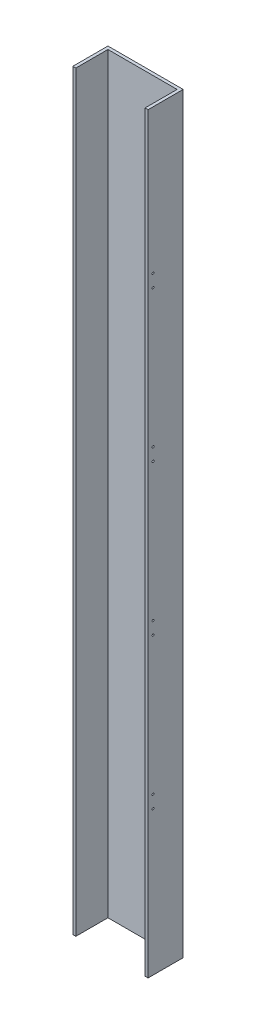
ISO-10303-21;
HEADER;
FILE_DESCRIPTION(('STEP AP214'),'2;1');
FILE_NAME('part.step','',(''),(''),'','','');
FILE_SCHEMA(('AUTOMOTIVE_DESIGN { 1 0 10303 214 1 1 1 1 }'));
ENDSEC;
DATA;
#1=APPLICATION_CONTEXT('core data for automotive mechanical design processes');
#2=APPLICATION_PROTOCOL_DEFINITION('international standard','automotive_design',2000,#1);
#3=PRODUCT_CONTEXT('',#1,'mechanical');
#4=PRODUCT('Part','Part','',(#3));
#5=PRODUCT_RELATED_PRODUCT_CATEGORY('part','',(#4));
#6=PRODUCT_DEFINITION_FORMATION('','',#4);
#7=PRODUCT_DEFINITION_CONTEXT('part definition',#1,'design');
#8=PRODUCT_DEFINITION('design','',#6,#7);
#9=PRODUCT_DEFINITION_SHAPE('','',#8);
#10=(LENGTH_UNIT() NAMED_UNIT(*) SI_UNIT(.MILLI.,.METRE.));
#11=(NAMED_UNIT(*) PLANE_ANGLE_UNIT() SI_UNIT($,.RADIAN.));
#12=(NAMED_UNIT(*) SI_UNIT($,.STERADIAN.) SOLID_ANGLE_UNIT());
#13=UNCERTAINTY_MEASURE_WITH_UNIT(LENGTH_MEASURE(1.E-05),#10,'distance_accuracy_value','');
#14=(GEOMETRIC_REPRESENTATION_CONTEXT(3) GLOBAL_UNCERTAINTY_ASSIGNED_CONTEXT((#13)) GLOBAL_UNIT_ASSIGNED_CONTEXT((#10,
#11,#12)) REPRESENTATION_CONTEXT('',''));
#15=CARTESIAN_POINT('',(0.,0.,0.));
#16=DIRECTION('',(0.,0.,1.));
#17=DIRECTION('',(1.,0.,0.));
#18=AXIS2_PLACEMENT_3D('',#15,#16,#17);
#19=CARTESIAN_POINT('',(75.,1500.,-35.));
#20=DIRECTION('',(0.,0.,1.));
#21=DIRECTION('',(1.,0.,0.));
#22=AXIS2_PLACEMENT_3D('',#19,#20,#21);
#23=PLANE('',#22);
#24=CARTESIAN_POINT('',(26.7499999999954,75.0000000000002,-35.));
#25=DIRECTION('',(0.,0.,-1.));
#26=DIRECTION('',(-1.,0.,0.));
#27=AXIS2_PLACEMENT_3D('',#24,#25,#26);
#28=CIRCLE('',#27,2.5);
#29=CARTESIAN_POINT('',(24.2499999999954,75.0000000000002,-35.));
#30=VERTEX_POINT('',#29);
#31=EDGE_CURVE('E342',#30,#30,#28,.T.);
#32=ORIENTED_EDGE('',*,*,#31,.F.);
#33=EDGE_LOOP('',(#32));
#34=FACE_BOUND('',#33,.T.);
#35=CARTESIAN_POINT('',(26.7499999999959,225.,-35.));
#36=DIRECTION('',(0.,0.,-1.));
#37=DIRECTION('',(-1.,0.,0.));
#38=AXIS2_PLACEMENT_3D('',#35,#36,#37);
#39=CIRCLE('',#38,2.5);
#40=CARTESIAN_POINT('',(24.2499999999959,225.,-35.));
#41=VERTEX_POINT('',#40);
#42=EDGE_CURVE('E334',#41,#41,#39,.T.);
#43=ORIENTED_EDGE('',*,*,#42,.F.);
#44=EDGE_LOOP('',(#43));
#45=FACE_BOUND('',#44,.T.);
#46=CARTESIAN_POINT('',(26.7499999999964,375.,-35.));
#47=DIRECTION('',(0.,0.,-1.));
#48=DIRECTION('',(-1.,0.,0.));
#49=AXIS2_PLACEMENT_3D('',#46,#47,#48);
#50=CIRCLE('',#49,2.5);
#51=CARTESIAN_POINT('',(24.2499999999964,375.,-35.));
#52=VERTEX_POINT('',#51);
#53=EDGE_CURVE('E326',#52,#52,#50,.T.);
#54=ORIENTED_EDGE('',*,*,#53,.F.);
#55=EDGE_LOOP('',(#54));
#56=FACE_BOUND('',#55,.T.);
#57=CARTESIAN_POINT('',(26.7499999999969,525.,-35.));
#58=DIRECTION('',(0.,0.,-1.));
#59=DIRECTION('',(-1.,0.,0.));
#60=AXIS2_PLACEMENT_3D('',#57,#58,#59);
#61=CIRCLE('',#60,2.5);
#62=CARTESIAN_POINT('',(24.2499999999969,525.,-35.));
#63=VERTEX_POINT('',#62);
#64=EDGE_CURVE('E318',#63,#63,#61,.T.);
#65=ORIENTED_EDGE('',*,*,#64,.F.);
#66=EDGE_LOOP('',(#65));
#67=FACE_BOUND('',#66,.T.);
#68=CARTESIAN_POINT('',(26.7499999999974,675.,-35.));
#69=DIRECTION('',(0.,0.,-1.));
#70=DIRECTION('',(-1.,0.,0.));
#71=AXIS2_PLACEMENT_3D('',#68,#69,#70);
#72=CIRCLE('',#71,2.5);
#73=CARTESIAN_POINT('',(24.2499999999974,675.,-35.));
#74=VERTEX_POINT('',#73);
#75=EDGE_CURVE('E310',#74,#74,#72,.T.);
#76=ORIENTED_EDGE('',*,*,#75,.F.);
#77=EDGE_LOOP('',(#76));
#78=FACE_BOUND('',#77,.T.);
#79=CARTESIAN_POINT('',(26.749999999998,825.,-35.));
#80=DIRECTION('',(0.,0.,-1.));
#81=DIRECTION('',(-1.,0.,0.));
#82=AXIS2_PLACEMENT_3D('',#79,#80,#81);
#83=CIRCLE('',#82,2.5);
#84=CARTESIAN_POINT('',(24.249999999998,825.,-35.));
#85=VERTEX_POINT('',#84);
#86=EDGE_CURVE('E302',#85,#85,#83,.T.);
#87=ORIENTED_EDGE('',*,*,#86,.F.);
#88=EDGE_LOOP('',(#87));
#89=FACE_BOUND('',#88,.T.);
#90=CARTESIAN_POINT('',(26.7499999999985,975.,-35.));
#91=DIRECTION('',(0.,0.,-1.));
#92=DIRECTION('',(-1.,0.,0.));
#93=AXIS2_PLACEMENT_3D('',#90,#91,#92);
#94=CIRCLE('',#93,2.5);
#95=CARTESIAN_POINT('',(24.2499999999985,975.,-35.));
#96=VERTEX_POINT('',#95);
#97=EDGE_CURVE('E294',#96,#96,#94,.T.);
#98=ORIENTED_EDGE('',*,*,#97,.F.);
#99=EDGE_LOOP('',(#98));
#100=FACE_BOUND('',#99,.T.);
#101=CARTESIAN_POINT('',(26.749999999999,1125.,-35.));
#102=DIRECTION('',(0.,0.,-1.));
#103=DIRECTION('',(-1.,0.,0.));
#104=AXIS2_PLACEMENT_3D('',#101,#102,#103);
#105=CIRCLE('',#104,2.50000000000011);
#106=CARTESIAN_POINT('',(24.2499999999989,1125.,-35.));
#107=VERTEX_POINT('',#106);
#108=EDGE_CURVE('E286',#107,#107,#105,.T.);
#109=ORIENTED_EDGE('',*,*,#108,.F.);
#110=EDGE_LOOP('',(#109));
#111=FACE_BOUND('',#110,.T.);
#112=CARTESIAN_POINT('',(26.7499999999995,1275.,-35.));
#113=DIRECTION('',(0.,0.,-1.));
#114=DIRECTION('',(-1.,0.,0.));
#115=AXIS2_PLACEMENT_3D('',#112,#113,#114);
#116=CIRCLE('',#115,2.50000000000011);
#117=CARTESIAN_POINT('',(24.2499999999994,1275.,-35.));
#118=VERTEX_POINT('',#117);
#119=EDGE_CURVE('E278',#118,#118,#116,.T.);
#120=ORIENTED_EDGE('',*,*,#119,.F.);
#121=EDGE_LOOP('',(#120));
#122=FACE_BOUND('',#121,.T.);
#123=CARTESIAN_POINT('',(26.75,1425.,-35.));
#124=DIRECTION('',(0.,0.,-1.));
#125=DIRECTION('',(-1.,0.,0.));
#126=AXIS2_PLACEMENT_3D('',#123,#124,#125);
#127=CIRCLE('',#126,2.50000000000012);
#128=CARTESIAN_POINT('',(24.2499999999999,1425.,-35.));
#129=VERTEX_POINT('',#128);
#130=EDGE_CURVE('E270',#129,#129,#127,.T.);
#131=ORIENTED_EDGE('',*,*,#130,.F.);
#132=EDGE_LOOP('',(#131));
#133=FACE_BOUND('',#132,.T.);
#134=DIRECTION('',(-1.,0.,0.));
#135=VECTOR('',#134,1.);
#136=CARTESIAN_POINT('',(75.,0.,-35.));
#137=LINE('',#136,#135);
#138=CARTESIAN_POINT('',(75.,0.,-35.));
#139=VERTEX_POINT('',#138);
#140=CARTESIAN_POINT('',(-75.,0.,-35.));
#141=VERTEX_POINT('',#140);
#142=EDGE_CURVE('E139',#139,#141,#137,.T.);
#143=ORIENTED_EDGE('',*,*,#142,.T.);
#144=DIRECTION('',(0.,-1.,0.));
#145=VECTOR('',#144,1.);
#146=CARTESIAN_POINT('',(-75.,1500.,-35.));
#147=LINE('',#146,#145);
#148=CARTESIAN_POINT('',(-75.,1500.,-35.));
#149=VERTEX_POINT('',#148);
#150=EDGE_CURVE('E11',#149,#141,#147,.T.);
#151=ORIENTED_EDGE('',*,*,#150,.F.);
#152=DIRECTION('',(-1.,0.,0.));
#153=VECTOR('',#152,1.);
#154=CARTESIAN_POINT('',(75.,1500.,-35.));
#155=LINE('',#154,#153);
#156=CARTESIAN_POINT('',(75.,1500.,-35.));
#157=VERTEX_POINT('',#156);
#158=EDGE_CURVE('E162',#157,#149,#155,.T.);
#159=ORIENTED_EDGE('',*,*,#158,.F.);
#160=DIRECTION('',(0.,-1.,0.));
#161=VECTOR('',#160,1.);
#162=CARTESIAN_POINT('',(75.,1500.,-35.));
#163=LINE('',#162,#161);
#164=EDGE_CURVE('E135',#157,#139,#163,.T.);
#165=ORIENTED_EDGE('',*,*,#164,.T.);
#166=EDGE_LOOP('',(#143,#151,#159,#165));
#167=FACE_BOUND('',#166,.T.);
#168=ADVANCED_FACE('F38',(#34,#45,#56,#67,#78,#89,#100,#111,#122,#133,#167),#23,.F.);
#169=CARTESIAN_POINT('',(-75.,1500.,-35.));
#170=DIRECTION('',(1.,0.,0.));
#171=DIRECTION('',(0.,0.,-1.));
#172=AXIS2_PLACEMENT_3D('',#169,#170,#171);
#173=PLANE('',#172);
#174=DIRECTION('',(0.,0.,1.));
#175=VECTOR('',#174,1.);
#176=CARTESIAN_POINT('',(-75.,0.,-35.));
#177=LINE('',#176,#175);
#178=CARTESIAN_POINT('',(-75.,0.,35.));
#179=VERTEX_POINT('',#178);
#180=EDGE_CURVE('E143',#141,#179,#177,.T.);
#181=ORIENTED_EDGE('',*,*,#180,.T.);
#182=DIRECTION('',(0.,-1.,0.));
#183=VECTOR('',#182,1.);
#184=CARTESIAN_POINT('',(-75.,1500.,35.));
#185=LINE('',#184,#183);
#186=CARTESIAN_POINT('',(-75.,1500.,35.));
#187=VERTEX_POINT('',#186);
#188=EDGE_CURVE('E47',#187,#179,#185,.T.);
#189=ORIENTED_EDGE('',*,*,#188,.F.);
#190=DIRECTION('',(0.,0.,1.));
#191=VECTOR('',#190,1.);
#192=CARTESIAN_POINT('',(-75.,1500.,-35.));
#193=LINE('',#192,#191);
#194=EDGE_CURVE('E98',#149,#187,#193,.T.);
#195=ORIENTED_EDGE('',*,*,#194,.F.);
#196=ORIENTED_EDGE('',*,*,#150,.T.);
#197=EDGE_LOOP('',(#181,#189,#195,#196));
#198=FACE_BOUND('',#197,.T.);
#199=ADVANCED_FACE('F361',(#198),#173,.F.);
#200=CARTESIAN_POINT('',(-75.,1500.,35.));
#201=DIRECTION('',(0.,0.,-1.));
#202=DIRECTION('',(-1.,0.,0.));
#203=AXIS2_PLACEMENT_3D('',#200,#201,#202);
#204=PLANE('',#203);
#205=DIRECTION('',(1.,0.,0.));
#206=VECTOR('',#205,1.);
#207=CARTESIAN_POINT('',(-75.,0.,35.));
#208=LINE('',#207,#206);
#209=CARTESIAN_POINT('',(-69.,0.,35.));
#210=VERTEX_POINT('',#209);
#211=EDGE_CURVE('E147',#179,#210,#208,.T.);
#212=ORIENTED_EDGE('',*,*,#211,.T.);
#213=DIRECTION('',(0.,-1.,0.));
#214=VECTOR('',#213,1.);
#215=CARTESIAN_POINT('',(-69.,1500.,35.));
#216=LINE('',#215,#214);
#217=CARTESIAN_POINT('',(-69.,1500.,35.));
#218=VERTEX_POINT('',#217);
#219=EDGE_CURVE('E173',#218,#210,#216,.T.);
#220=ORIENTED_EDGE('',*,*,#219,.F.);
#221=DIRECTION('',(1.,0.,0.));
#222=VECTOR('',#221,1.);
#223=CARTESIAN_POINT('',(-75.,1500.,35.));
#224=LINE('',#223,#222);
#225=EDGE_CURVE('E183',#187,#218,#224,.T.);
#226=ORIENTED_EDGE('',*,*,#225,.F.);
#227=ORIENTED_EDGE('',*,*,#188,.T.);
#228=EDGE_LOOP('',(#212,#220,#226,#227));
#229=FACE_BOUND('',#228,.T.);
#230=ADVANCED_FACE('F181',(#229),#204,.F.);
#231=CARTESIAN_POINT('',(-69.,1500.,35.));
#232=DIRECTION('',(-1.,0.,0.));
#233=DIRECTION('',(0.,0.,1.));
#234=AXIS2_PLACEMENT_3D('',#231,#232,#233);
#235=PLANE('',#234);
#236=DIRECTION('',(0.,0.,-1.));
#237=VECTOR('',#236,1.);
#238=CARTESIAN_POINT('',(-69.,0.,35.));
#239=LINE('',#238,#237);
#240=CARTESIAN_POINT('',(-69.,0.,-29.));
#241=VERTEX_POINT('',#240);
#242=EDGE_CURVE('E150',#210,#241,#239,.T.);
#243=ORIENTED_EDGE('',*,*,#242,.T.);
#244=DIRECTION('',(0.,-1.,0.));
#245=VECTOR('',#244,1.);
#246=CARTESIAN_POINT('',(-69.,1500.,-29.));
#247=LINE('',#246,#245);
#248=CARTESIAN_POINT('',(-69.,1500.,-29.));
#249=VERTEX_POINT('',#248);
#250=EDGE_CURVE('E169',#249,#241,#247,.T.);
#251=ORIENTED_EDGE('',*,*,#250,.F.);
#252=DIRECTION('',(0.,0.,-1.));
#253=VECTOR('',#252,1.);
#254=CARTESIAN_POINT('',(-69.,1500.,35.));
#255=LINE('',#254,#253);
#256=EDGE_CURVE('E196',#218,#249,#255,.T.);
#257=ORIENTED_EDGE('',*,*,#256,.F.);
#258=ORIENTED_EDGE('',*,*,#219,.T.);
#259=EDGE_LOOP('',(#243,#251,#257,#258));
#260=FACE_BOUND('',#259,.T.);
#261=ADVANCED_FACE('F191',(#260),#235,.F.);
#262=CARTESIAN_POINT('',(-69.,1500.,-29.));
#263=DIRECTION('',(0.,0.,-1.));
#264=DIRECTION('',(-1.,0.,0.));
#265=AXIS2_PLACEMENT_3D('',#262,#263,#264);
#266=PLANE('',#265);
#267=CARTESIAN_POINT('',(26.7499999999954,75.0000000000002,-29.));
#268=DIRECTION('',(0.,0.,-1.));
#269=DIRECTION('',(-1.,0.,0.));
#270=AXIS2_PLACEMENT_3D('',#267,#268,#269);
#271=CIRCLE('',#270,2.5);
#272=CARTESIAN_POINT('',(24.2499999999954,75.0000000000002,-29.));
#273=VERTEX_POINT('',#272);
#274=EDGE_CURVE('E266',#273,#273,#271,.T.);
#275=ORIENTED_EDGE('',*,*,#274,.T.);
#276=EDGE_LOOP('',(#275));
#277=FACE_BOUND('',#276,.T.);
#278=CARTESIAN_POINT('',(26.7499999999959,225.,-29.));
#279=DIRECTION('',(0.,0.,-1.));
#280=DIRECTION('',(-1.,0.,0.));
#281=AXIS2_PLACEMENT_3D('',#278,#279,#280);
#282=CIRCLE('',#281,2.5);
#283=CARTESIAN_POINT('',(24.2499999999959,225.,-29.));
#284=VERTEX_POINT('',#283);
#285=EDGE_CURVE('E338',#284,#284,#282,.T.);
#286=ORIENTED_EDGE('',*,*,#285,.T.);
#287=EDGE_LOOP('',(#286));
#288=FACE_BOUND('',#287,.T.);
#289=CARTESIAN_POINT('',(26.7499999999964,375.,-29.));
#290=DIRECTION('',(0.,0.,-1.));
#291=DIRECTION('',(-1.,0.,0.));
#292=AXIS2_PLACEMENT_3D('',#289,#290,#291);
#293=CIRCLE('',#292,2.5);
#294=CARTESIAN_POINT('',(24.2499999999964,375.,-29.));
#295=VERTEX_POINT('',#294);
#296=EDGE_CURVE('E330',#295,#295,#293,.T.);
#297=ORIENTED_EDGE('',*,*,#296,.T.);
#298=EDGE_LOOP('',(#297));
#299=FACE_BOUND('',#298,.T.);
#300=CARTESIAN_POINT('',(26.7499999999969,525.,-29.));
#301=DIRECTION('',(0.,0.,-1.));
#302=DIRECTION('',(-1.,0.,0.));
#303=AXIS2_PLACEMENT_3D('',#300,#301,#302);
#304=CIRCLE('',#303,2.5);
#305=CARTESIAN_POINT('',(24.2499999999969,525.,-29.));
#306=VERTEX_POINT('',#305);
#307=EDGE_CURVE('E322',#306,#306,#304,.T.);
#308=ORIENTED_EDGE('',*,*,#307,.T.);
#309=EDGE_LOOP('',(#308));
#310=FACE_BOUND('',#309,.T.);
#311=CARTESIAN_POINT('',(26.7499999999974,675.,-29.));
#312=DIRECTION('',(0.,0.,-1.));
#313=DIRECTION('',(-1.,0.,0.));
#314=AXIS2_PLACEMENT_3D('',#311,#312,#313);
#315=CIRCLE('',#314,2.5);
#316=CARTESIAN_POINT('',(24.2499999999974,675.,-29.));
#317=VERTEX_POINT('',#316);
#318=EDGE_CURVE('E314',#317,#317,#315,.T.);
#319=ORIENTED_EDGE('',*,*,#318,.T.);
#320=EDGE_LOOP('',(#319));
#321=FACE_BOUND('',#320,.T.);
#322=CARTESIAN_POINT('',(26.749999999998,825.,-29.));
#323=DIRECTION('',(0.,0.,-1.));
#324=DIRECTION('',(-1.,0.,0.));
#325=AXIS2_PLACEMENT_3D('',#322,#323,#324);
#326=CIRCLE('',#325,2.5);
#327=CARTESIAN_POINT('',(24.249999999998,825.,-29.));
#328=VERTEX_POINT('',#327);
#329=EDGE_CURVE('E306',#328,#328,#326,.T.);
#330=ORIENTED_EDGE('',*,*,#329,.T.);
#331=EDGE_LOOP('',(#330));
#332=FACE_BOUND('',#331,.T.);
#333=CARTESIAN_POINT('',(26.7499999999985,975.,-29.));
#334=DIRECTION('',(0.,0.,-1.));
#335=DIRECTION('',(-1.,0.,0.));
#336=AXIS2_PLACEMENT_3D('',#333,#334,#335);
#337=CIRCLE('',#336,2.5);
#338=CARTESIAN_POINT('',(24.2499999999985,975.,-29.));
#339=VERTEX_POINT('',#338);
#340=EDGE_CURVE('E298',#339,#339,#337,.T.);
#341=ORIENTED_EDGE('',*,*,#340,.T.);
#342=EDGE_LOOP('',(#341));
#343=FACE_BOUND('',#342,.T.);
#344=CARTESIAN_POINT('',(26.749999999999,1125.,-29.));
#345=DIRECTION('',(0.,0.,-1.));
#346=DIRECTION('',(-1.,0.,0.));
#347=AXIS2_PLACEMENT_3D('',#344,#345,#346);
#348=CIRCLE('',#347,2.50000000000011);
#349=CARTESIAN_POINT('',(24.2499999999989,1125.,-29.));
#350=VERTEX_POINT('',#349);
#351=EDGE_CURVE('E290',#350,#350,#348,.T.);
#352=ORIENTED_EDGE('',*,*,#351,.T.);
#353=EDGE_LOOP('',(#352));
#354=FACE_BOUND('',#353,.T.);
#355=CARTESIAN_POINT('',(26.7499999999995,1275.,-29.));
#356=DIRECTION('',(0.,0.,-1.));
#357=DIRECTION('',(-1.,0.,0.));
#358=AXIS2_PLACEMENT_3D('',#355,#356,#357);
#359=CIRCLE('',#358,2.50000000000011);
#360=CARTESIAN_POINT('',(24.2499999999994,1275.,-29.));
#361=VERTEX_POINT('',#360);
#362=EDGE_CURVE('E282',#361,#361,#359,.T.);
#363=ORIENTED_EDGE('',*,*,#362,.T.);
#364=EDGE_LOOP('',(#363));
#365=FACE_BOUND('',#364,.T.);
#366=CARTESIAN_POINT('',(26.75,1425.,-29.));
#367=DIRECTION('',(0.,0.,-1.));
#368=DIRECTION('',(-1.,0.,0.));
#369=AXIS2_PLACEMENT_3D('',#366,#367,#368);
#370=CIRCLE('',#369,2.50000000000012);
#371=CARTESIAN_POINT('',(24.2499999999999,1425.,-29.));
#372=VERTEX_POINT('',#371);
#373=EDGE_CURVE('E274',#372,#372,#370,.T.);
#374=ORIENTED_EDGE('',*,*,#373,.T.);
#375=EDGE_LOOP('',(#374));
#376=FACE_BOUND('',#375,.T.);
#377=DIRECTION('',(1.,0.,0.));
#378=VECTOR('',#377,1.);
#379=CARTESIAN_POINT('',(-69.,0.,-29.));
#380=LINE('',#379,#378);
#381=CARTESIAN_POINT('',(69.,0.,-29.));
#382=VERTEX_POINT('',#381);
#383=EDGE_CURVE('E153',#241,#382,#380,.T.);
#384=ORIENTED_EDGE('',*,*,#383,.T.);
#385=DIRECTION('',(0.,-1.,0.));
#386=VECTOR('',#385,1.);
#387=CARTESIAN_POINT('',(69.,1500.,-29.));
#388=LINE('',#387,#386);
#389=CARTESIAN_POINT('',(69.,1500.,-29.));
#390=VERTEX_POINT('',#389);
#391=EDGE_CURVE('E128',#390,#382,#388,.T.);
#392=ORIENTED_EDGE('',*,*,#391,.F.);
#393=DIRECTION('',(1.,0.,0.));
#394=VECTOR('',#393,1.);
#395=CARTESIAN_POINT('',(-69.,1500.,-29.));
#396=LINE('',#395,#394);
#397=EDGE_CURVE('E117',#249,#390,#396,.T.);
#398=ORIENTED_EDGE('',*,*,#397,.F.);
#399=ORIENTED_EDGE('',*,*,#250,.T.);
#400=EDGE_LOOP('',(#384,#392,#398,#399));
#401=FACE_BOUND('',#400,.T.);
#402=ADVANCED_FACE('F194',(#277,#288,#299,#310,#321,#332,#343,#354,#365,#376,#401),#266,.F.);
#403=CARTESIAN_POINT('',(69.,1500.,-29.));
#404=DIRECTION('',(1.,0.,0.));
#405=DIRECTION('',(0.,0.,-1.));
#406=AXIS2_PLACEMENT_3D('',#403,#404,#405);
#407=PLANE('',#406);
#408=CARTESIAN_POINT('',(69.,587.5,25.));
#409=DIRECTION('',(1.,0.,0.));
#410=DIRECTION('',(0.,0.,-1.));
#411=AXIS2_PLACEMENT_3D('',#408,#409,#410);
#412=CIRCLE('',#411,1.99999999999999);
#413=CARTESIAN_POINT('',(69.,587.5,23.));
#414=VERTEX_POINT('',#413);
#415=EDGE_CURVE('E210',#414,#414,#412,.T.);
#416=ORIENTED_EDGE('',*,*,#415,.T.);
#417=EDGE_LOOP('',(#416));
#418=FACE_BOUND('',#417,.T.);
#419=CARTESIAN_POINT('',(69.,287.5,25.));
#420=DIRECTION('',(1.,0.,0.));
#421=DIRECTION('',(0.,0.,-1.));
#422=AXIS2_PLACEMENT_3D('',#419,#420,#421);
#423=CIRCLE('',#422,2.00000000000001);
#424=CARTESIAN_POINT('',(69.,287.5,23.));
#425=VERTEX_POINT('',#424);
#426=EDGE_CURVE('E235',#425,#425,#423,.T.);
#427=ORIENTED_EDGE('',*,*,#426,.T.);
#428=EDGE_LOOP('',(#427));
#429=FACE_BOUND('',#428,.T.);
#430=CARTESIAN_POINT('',(69.,612.5,25.));
#431=DIRECTION('',(1.,0.,0.));
#432=DIRECTION('',(0.,0.,-1.));
#433=AXIS2_PLACEMENT_3D('',#430,#431,#432);
#434=CIRCLE('',#433,2.00000000000003);
#435=CARTESIAN_POINT('',(69.,612.5,23.));
#436=VERTEX_POINT('',#435);
#437=EDGE_CURVE('E227',#436,#436,#434,.T.);
#438=ORIENTED_EDGE('',*,*,#437,.T.);
#439=EDGE_LOOP('',(#438));
#440=FACE_BOUND('',#439,.T.);
#441=CARTESIAN_POINT('',(69.,1212.5,25.));
#442=DIRECTION('',(1.,0.,0.));
#443=DIRECTION('',(0.,0.,1.));
#444=AXIS2_PLACEMENT_3D('',#441,#442,#443);
#445=CIRCLE('',#444,2.00000000000001);
#446=CARTESIAN_POINT('',(69.,1212.5,27.));
#447=VERTEX_POINT('',#446);
#448=EDGE_CURVE('E218',#447,#447,#445,.T.);
#449=ORIENTED_EDGE('',*,*,#448,.T.);
#450=EDGE_LOOP('',(#449));
#451=FACE_BOUND('',#450,.T.);
#452=CARTESIAN_POINT('',(69.,912.5,25.));
#453=DIRECTION('',(1.,0.,0.));
#454=DIRECTION('',(0.,0.,1.));
#455=AXIS2_PLACEMENT_3D('',#452,#453,#454);
#456=CIRCLE('',#455,1.99999999999999);
#457=CARTESIAN_POINT('',(69.,912.5,27.));
#458=VERTEX_POINT('',#457);
#459=EDGE_CURVE('E251',#458,#458,#456,.T.);
#460=ORIENTED_EDGE('',*,*,#459,.T.);
#461=EDGE_LOOP('',(#460));
#462=FACE_BOUND('',#461,.T.);
#463=CARTESIAN_POINT('',(69.,887.5,25.));
#464=DIRECTION('',(1.,0.,0.));
#465=DIRECTION('',(0.,0.,1.));
#466=AXIS2_PLACEMENT_3D('',#463,#464,#465);
#467=CIRCLE('',#466,2.00000000000003);
#468=CARTESIAN_POINT('',(69.,887.5,27.));
#469=VERTEX_POINT('',#468);
#470=EDGE_CURVE('E250',#469,#469,#467,.T.);
#471=ORIENTED_EDGE('',*,*,#470,.T.);
#472=EDGE_LOOP('',(#471));
#473=FACE_BOUND('',#472,.T.);
#474=CARTESIAN_POINT('',(69.,1187.5,25.));
#475=DIRECTION('',(1.,0.,0.));
#476=DIRECTION('',(0.,0.,1.));
#477=AXIS2_PLACEMENT_3D('',#474,#475,#476);
#478=CIRCLE('',#477,2.);
#479=CARTESIAN_POINT('',(69.,1187.5,27.));
#480=VERTEX_POINT('',#479);
#481=EDGE_CURVE('E219',#480,#480,#478,.T.);
#482=ORIENTED_EDGE('',*,*,#481,.T.);
#483=EDGE_LOOP('',(#482));
#484=FACE_BOUND('',#483,.T.);
#485=CARTESIAN_POINT('',(69.,312.5,25.));
#486=DIRECTION('',(1.,0.,0.));
#487=DIRECTION('',(0.,0.,-1.));
#488=AXIS2_PLACEMENT_3D('',#485,#486,#487);
#489=CIRCLE('',#488,2.);
#490=CARTESIAN_POINT('',(69.,312.5,23.));
#491=VERTEX_POINT('',#490);
#492=EDGE_CURVE('E144',#491,#491,#489,.T.);
#493=ORIENTED_EDGE('',*,*,#492,.T.);
#494=EDGE_LOOP('',(#493));
#495=FACE_BOUND('',#494,.T.);
#496=DIRECTION('',(0.,0.,1.));
#497=VECTOR('',#496,1.);
#498=CARTESIAN_POINT('',(69.,0.,-29.));
#499=LINE('',#498,#497);
#500=CARTESIAN_POINT('',(69.,0.,35.));
#501=VERTEX_POINT('',#500);
#502=EDGE_CURVE('E126',#382,#501,#499,.T.);
#503=ORIENTED_EDGE('',*,*,#502,.T.);
#504=DIRECTION('',(0.,-1.,0.));
#505=VECTOR('',#504,1.);
#506=CARTESIAN_POINT('',(69.,1500.,35.));
#507=LINE('',#506,#505);
#508=CARTESIAN_POINT('',(69.,1500.,35.));
#509=VERTEX_POINT('',#508);
#510=EDGE_CURVE('E123',#509,#501,#507,.T.);
#511=ORIENTED_EDGE('',*,*,#510,.F.);
#512=DIRECTION('',(0.,0.,1.));
#513=VECTOR('',#512,1.);
#514=CARTESIAN_POINT('',(69.,1500.,-29.));
#515=LINE('',#514,#513);
#516=EDGE_CURVE('E111',#390,#509,#515,.T.);
#517=ORIENTED_EDGE('',*,*,#516,.F.);
#518=ORIENTED_EDGE('',*,*,#391,.T.);
#519=EDGE_LOOP('',(#503,#511,#517,#518));
#520=FACE_BOUND('',#519,.T.);
#521=ADVANCED_FACE('F124',(#418,#429,#440,#451,#462,#473,#484,#495,#520),#407,.F.);
#522=CARTESIAN_POINT('',(69.,1500.,35.));
#523=DIRECTION('',(0.,0.,-1.));
#524=DIRECTION('',(-1.,0.,0.));
#525=AXIS2_PLACEMENT_3D('',#522,#523,#524);
#526=PLANE('',#525);
#527=DIRECTION('',(1.,0.,0.));
#528=VECTOR('',#527,1.);
#529=CARTESIAN_POINT('',(69.,0.,35.));
#530=LINE('',#529,#528);
#531=CARTESIAN_POINT('',(75.,0.,35.));
#532=VERTEX_POINT('',#531);
#533=EDGE_CURVE('E84',#501,#532,#530,.T.);
#534=ORIENTED_EDGE('',*,*,#533,.T.);
#535=DIRECTION('',(0.,-1.,0.));
#536=VECTOR('',#535,1.);
#537=CARTESIAN_POINT('',(75.,1500.,35.));
#538=LINE('',#537,#536);
#539=CARTESIAN_POINT('',(75.,1500.,35.));
#540=VERTEX_POINT('',#539);
#541=EDGE_CURVE('E129',#540,#532,#538,.T.);
#542=ORIENTED_EDGE('',*,*,#541,.F.);
#543=DIRECTION('',(1.,0.,0.));
#544=VECTOR('',#543,1.);
#545=CARTESIAN_POINT('',(69.,1500.,35.));
#546=LINE('',#545,#544);
#547=EDGE_CURVE('E115',#509,#540,#546,.T.);
#548=ORIENTED_EDGE('',*,*,#547,.F.);
#549=ORIENTED_EDGE('',*,*,#510,.T.);
#550=EDGE_LOOP('',(#534,#542,#548,#549));
#551=FACE_BOUND('',#550,.T.);
#552=ADVANCED_FACE('F131',(#551),#526,.F.);
#553=CARTESIAN_POINT('',(75.,1500.,35.));
#554=DIRECTION('',(-1.,0.,0.));
#555=DIRECTION('',(0.,0.,1.));
#556=AXIS2_PLACEMENT_3D('',#553,#554,#555);
#557=PLANE('',#556);
#558=CARTESIAN_POINT('',(75.,587.5,25.));
#559=DIRECTION('',(1.,0.,0.));
#560=DIRECTION('',(0.,0.,-1.));
#561=AXIS2_PLACEMENT_3D('',#558,#559,#560);
#562=CIRCLE('',#561,1.99999999999999);
#563=CARTESIAN_POINT('',(75.,587.5,23.));
#564=VERTEX_POINT('',#563);
#565=EDGE_CURVE('E239',#564,#564,#562,.T.);
#566=ORIENTED_EDGE('',*,*,#565,.F.);
#567=EDGE_LOOP('',(#566));
#568=FACE_BOUND('',#567,.T.);
#569=CARTESIAN_POINT('',(75.,287.5,25.));
#570=DIRECTION('',(1.,0.,0.));
#571=DIRECTION('',(0.,0.,-1.));
#572=AXIS2_PLACEMENT_3D('',#569,#570,#571);
#573=CIRCLE('',#572,2.00000000000001);
#574=CARTESIAN_POINT('',(75.,287.5,23.));
#575=VERTEX_POINT('',#574);
#576=EDGE_CURVE('E231',#575,#575,#573,.T.);
#577=ORIENTED_EDGE('',*,*,#576,.F.);
#578=EDGE_LOOP('',(#577));
#579=FACE_BOUND('',#578,.T.);
#580=CARTESIAN_POINT('',(75.,612.5,25.));
#581=DIRECTION('',(1.,0.,0.));
#582=DIRECTION('',(0.,0.,-1.));
#583=AXIS2_PLACEMENT_3D('',#580,#581,#582);
#584=CIRCLE('',#583,2.00000000000003);
#585=CARTESIAN_POINT('',(75.,612.5,23.));
#586=VERTEX_POINT('',#585);
#587=EDGE_CURVE('E223',#586,#586,#584,.T.);
#588=ORIENTED_EDGE('',*,*,#587,.F.);
#589=EDGE_LOOP('',(#588));
#590=FACE_BOUND('',#589,.T.);
#591=CARTESIAN_POINT('',(75.,1212.5,25.));
#592=DIRECTION('',(1.,0.,0.));
#593=DIRECTION('',(0.,0.,1.));
#594=AXIS2_PLACEMENT_3D('',#591,#592,#593);
#595=CIRCLE('',#594,2.00000000000001);
#596=CARTESIAN_POINT('',(75.,1212.5,27.));
#597=VERTEX_POINT('',#596);
#598=EDGE_CURVE('E214',#597,#597,#595,.T.);
#599=ORIENTED_EDGE('',*,*,#598,.F.);
#600=EDGE_LOOP('',(#599));
#601=FACE_BOUND('',#600,.T.);
#602=CARTESIAN_POINT('',(75.,912.5,25.));
#603=DIRECTION('',(1.,0.,0.));
#604=DIRECTION('',(0.,0.,1.));
#605=AXIS2_PLACEMENT_3D('',#602,#603,#604);
#606=CIRCLE('',#605,1.99999999999999);
#607=CARTESIAN_POINT('',(75.,912.5,27.));
#608=VERTEX_POINT('',#607);
#609=EDGE_CURVE('E262',#608,#608,#606,.T.);
#610=ORIENTED_EDGE('',*,*,#609,.F.);
#611=EDGE_LOOP('',(#610));
#612=FACE_BOUND('',#611,.T.);
#613=CARTESIAN_POINT('',(75.,887.5,25.));
#614=DIRECTION('',(1.,0.,0.));
#615=DIRECTION('',(0.,0.,1.));
#616=AXIS2_PLACEMENT_3D('',#613,#614,#615);
#617=CIRCLE('',#616,2.00000000000003);
#618=CARTESIAN_POINT('',(75.,887.5,27.));
#619=VERTEX_POINT('',#618);
#620=EDGE_CURVE('E246',#619,#619,#617,.T.);
#621=ORIENTED_EDGE('',*,*,#620,.F.);
#622=EDGE_LOOP('',(#621));
#623=FACE_BOUND('',#622,.T.);
#624=CARTESIAN_POINT('',(75.,1187.5,25.));
#625=DIRECTION('',(1.,0.,0.));
#626=DIRECTION('',(0.,0.,1.));
#627=AXIS2_PLACEMENT_3D('',#624,#625,#626);
#628=CIRCLE('',#627,2.);
#629=CARTESIAN_POINT('',(75.,1187.5,27.));
#630=VERTEX_POINT('',#629);
#631=EDGE_CURVE('E255',#630,#630,#628,.T.);
#632=ORIENTED_EDGE('',*,*,#631,.F.);
#633=EDGE_LOOP('',(#632));
#634=FACE_BOUND('',#633,.T.);
#635=CARTESIAN_POINT('',(75.,312.5,25.));
#636=DIRECTION('',(1.,0.,0.));
#637=DIRECTION('',(0.,0.,-1.));
#638=AXIS2_PLACEMENT_3D('',#635,#636,#637);
#639=CIRCLE('',#638,2.);
#640=CARTESIAN_POINT('',(75.,312.5,23.));
#641=VERTEX_POINT('',#640);
#642=EDGE_CURVE('E206',#641,#641,#639,.T.);
#643=ORIENTED_EDGE('',*,*,#642,.F.);
#644=EDGE_LOOP('',(#643));
#645=FACE_BOUND('',#644,.T.);
#646=DIRECTION('',(0.,0.,-1.));
#647=VECTOR('',#646,1.);
#648=CARTESIAN_POINT('',(75.,0.,35.));
#649=LINE('',#648,#647);
#650=EDGE_CURVE('E90',#532,#139,#649,.T.);
#651=ORIENTED_EDGE('',*,*,#650,.T.);
#652=ORIENTED_EDGE('',*,*,#164,.F.);
#653=DIRECTION('',(0.,0.,-1.));
#654=VECTOR('',#653,1.);
#655=CARTESIAN_POINT('',(75.,1500.,35.));
#656=LINE('',#655,#654);
#657=EDGE_CURVE('E55',#540,#157,#656,.T.);
#658=ORIENTED_EDGE('',*,*,#657,.F.);
#659=ORIENTED_EDGE('',*,*,#541,.T.);
#660=EDGE_LOOP('',(#651,#652,#658,#659));
#661=FACE_BOUND('',#660,.T.);
#662=ADVANCED_FACE('F382',(#568,#579,#590,#601,#612,#623,#634,#645,#661),#557,.F.);
#663=CARTESIAN_POINT('',(0.,1500.,0.));
#664=DIRECTION('',(0.,1.,0.));
#665=DIRECTION('',(0.,0.,1.));
#666=AXIS2_PLACEMENT_3D('',#663,#664,#665);
#667=PLANE('',#666);
#668=ORIENTED_EDGE('',*,*,#158,.T.);
#669=ORIENTED_EDGE('',*,*,#194,.T.);
#670=ORIENTED_EDGE('',*,*,#225,.T.);
#671=ORIENTED_EDGE('',*,*,#256,.T.);
#672=ORIENTED_EDGE('',*,*,#397,.T.);
#673=ORIENTED_EDGE('',*,*,#516,.T.);
#674=ORIENTED_EDGE('',*,*,#547,.T.);
#675=ORIENTED_EDGE('',*,*,#657,.T.);
#676=EDGE_LOOP('',(#668,#669,#670,#671,#672,#673,#674,#675));
#677=FACE_BOUND('',#676,.T.);
#678=ADVANCED_FACE('F113',(#677),#667,.T.);
#679=CARTESIAN_POINT('',(0.,0.,0.));
#680=DIRECTION('',(0.,1.,0.));
#681=DIRECTION('',(0.,0.,1.));
#682=AXIS2_PLACEMENT_3D('',#679,#680,#681);
#683=PLANE('',#682);
#684=ORIENTED_EDGE('',*,*,#142,.F.);
#685=ORIENTED_EDGE('',*,*,#650,.F.);
#686=ORIENTED_EDGE('',*,*,#533,.F.);
#687=ORIENTED_EDGE('',*,*,#502,.F.);
#688=ORIENTED_EDGE('',*,*,#383,.F.);
#689=ORIENTED_EDGE('',*,*,#242,.F.);
#690=ORIENTED_EDGE('',*,*,#211,.F.);
#691=ORIENTED_EDGE('',*,*,#180,.F.);
#692=EDGE_LOOP('',(#684,#685,#686,#687,#688,#689,#690,#691));
#693=FACE_BOUND('',#692,.T.);
#694=ADVANCED_FACE('F187',(#693),#683,.F.);
#695=CARTESIAN_POINT('',(69.,312.5,25.));
#696=DIRECTION('',(1.,0.,0.));
#697=DIRECTION('',(0.,0.,-1.));
#698=AXIS2_PLACEMENT_3D('',#695,#696,#697);
#699=CYLINDRICAL_SURFACE('',#698,2.);
#700=ORIENTED_EDGE('',*,*,#492,.F.);
#701=EDGE_LOOP('',(#700));
#702=FACE_BOUND('',#701,.T.);
#703=ORIENTED_EDGE('',*,*,#642,.T.);
#704=EDGE_LOOP('',(#703));
#705=FACE_BOUND('',#704,.T.);
#706=ADVANCED_FACE('F450',(#702,#705),#699,.F.);
#707=CARTESIAN_POINT('',(69.,1187.5,25.));
#708=DIRECTION('',(1.,0.,0.));
#709=DIRECTION('',(0.,0.,-1.));
#710=AXIS2_PLACEMENT_3D('',#707,#708,#709);
#711=CYLINDRICAL_SURFACE('',#710,2.);
#712=ORIENTED_EDGE('',*,*,#481,.F.);
#713=EDGE_LOOP('',(#712));
#714=FACE_BOUND('',#713,.T.);
#715=ORIENTED_EDGE('',*,*,#631,.T.);
#716=EDGE_LOOP('',(#715));
#717=FACE_BOUND('',#716,.T.);
#718=ADVANCED_FACE('F455',(#714,#717),#711,.F.);
#719=CARTESIAN_POINT('',(69.,887.5,25.));
#720=DIRECTION('',(1.,0.,0.));
#721=DIRECTION('',(0.,0.,-1.));
#722=AXIS2_PLACEMENT_3D('',#719,#720,#721);
#723=CYLINDRICAL_SURFACE('',#722,2.00000000000003);
#724=ORIENTED_EDGE('',*,*,#470,.F.);
#725=EDGE_LOOP('',(#724));
#726=FACE_BOUND('',#725,.T.);
#727=ORIENTED_EDGE('',*,*,#620,.T.);
#728=EDGE_LOOP('',(#727));
#729=FACE_BOUND('',#728,.T.);
#730=ADVANCED_FACE('F463',(#726,#729),#723,.F.);
#731=CARTESIAN_POINT('',(69.,912.5,25.));
#732=DIRECTION('',(1.,0.,0.));
#733=DIRECTION('',(0.,0.,-1.));
#734=AXIS2_PLACEMENT_3D('',#731,#732,#733);
#735=CYLINDRICAL_SURFACE('',#734,1.99999999999999);
#736=ORIENTED_EDGE('',*,*,#459,.F.);
#737=EDGE_LOOP('',(#736));
#738=FACE_BOUND('',#737,.T.);
#739=ORIENTED_EDGE('',*,*,#609,.T.);
#740=EDGE_LOOP('',(#739));
#741=FACE_BOUND('',#740,.T.);
#742=ADVANCED_FACE('F471',(#738,#741),#735,.F.);
#743=CARTESIAN_POINT('',(69.,1212.5,25.));
#744=DIRECTION('',(1.,0.,0.));
#745=DIRECTION('',(0.,0.,-1.));
#746=AXIS2_PLACEMENT_3D('',#743,#744,#745);
#747=CYLINDRICAL_SURFACE('',#746,2.00000000000001);
#748=ORIENTED_EDGE('',*,*,#448,.F.);
#749=EDGE_LOOP('',(#748));
#750=FACE_BOUND('',#749,.T.);
#751=ORIENTED_EDGE('',*,*,#598,.T.);
#752=EDGE_LOOP('',(#751));
#753=FACE_BOUND('',#752,.T.);
#754=ADVANCED_FACE('F479',(#750,#753),#747,.F.);
#755=CARTESIAN_POINT('',(69.,612.5,25.));
#756=DIRECTION('',(1.,0.,0.));
#757=DIRECTION('',(0.,0.,-1.));
#758=AXIS2_PLACEMENT_3D('',#755,#756,#757);
#759=CYLINDRICAL_SURFACE('',#758,2.00000000000003);
#760=ORIENTED_EDGE('',*,*,#437,.F.);
#761=EDGE_LOOP('',(#760));
#762=FACE_BOUND('',#761,.T.);
#763=ORIENTED_EDGE('',*,*,#587,.T.);
#764=EDGE_LOOP('',(#763));
#765=FACE_BOUND('',#764,.T.);
#766=ADVANCED_FACE('F487',(#762,#765),#759,.F.);
#767=CARTESIAN_POINT('',(69.,287.5,25.));
#768=DIRECTION('',(1.,0.,0.));
#769=DIRECTION('',(0.,0.,-1.));
#770=AXIS2_PLACEMENT_3D('',#767,#768,#769);
#771=CYLINDRICAL_SURFACE('',#770,2.00000000000001);
#772=ORIENTED_EDGE('',*,*,#426,.F.);
#773=EDGE_LOOP('',(#772));
#774=FACE_BOUND('',#773,.T.);
#775=ORIENTED_EDGE('',*,*,#576,.T.);
#776=EDGE_LOOP('',(#775));
#777=FACE_BOUND('',#776,.T.);
#778=ADVANCED_FACE('F495',(#774,#777),#771,.F.);
#779=CARTESIAN_POINT('',(69.,587.5,25.));
#780=DIRECTION('',(1.,0.,0.));
#781=DIRECTION('',(0.,0.,-1.));
#782=AXIS2_PLACEMENT_3D('',#779,#780,#781);
#783=CYLINDRICAL_SURFACE('',#782,1.99999999999999);
#784=ORIENTED_EDGE('',*,*,#415,.F.);
#785=EDGE_LOOP('',(#784));
#786=FACE_BOUND('',#785,.T.);
#787=ORIENTED_EDGE('',*,*,#565,.T.);
#788=EDGE_LOOP('',(#787));
#789=FACE_BOUND('',#788,.T.);
#790=ADVANCED_FACE('F503',(#786,#789),#783,.F.);
#791=CARTESIAN_POINT('',(26.75,1425.,-29.));
#792=DIRECTION('',(0.,0.,-1.));
#793=DIRECTION('',(-1.,0.,0.));
#794=AXIS2_PLACEMENT_3D('',#791,#792,#793);
#795=CYLINDRICAL_SURFACE('',#794,2.50000000000012);
#796=ORIENTED_EDGE('',*,*,#373,.F.);
#797=EDGE_LOOP('',(#796));
#798=FACE_BOUND('',#797,.T.);
#799=ORIENTED_EDGE('',*,*,#130,.T.);
#800=EDGE_LOOP('',(#799));
#801=FACE_BOUND('',#800,.T.);
#802=ADVANCED_FACE('F511',(#798,#801),#795,.F.);
#803=CARTESIAN_POINT('',(26.7499999999995,1275.,-29.));
#804=DIRECTION('',(0.,0.,-1.));
#805=DIRECTION('',(-1.,0.,0.));
#806=AXIS2_PLACEMENT_3D('',#803,#804,#805);
#807=CYLINDRICAL_SURFACE('',#806,2.50000000000011);
#808=ORIENTED_EDGE('',*,*,#362,.F.);
#809=EDGE_LOOP('',(#808));
#810=FACE_BOUND('',#809,.T.);
#811=ORIENTED_EDGE('',*,*,#119,.T.);
#812=EDGE_LOOP('',(#811));
#813=FACE_BOUND('',#812,.T.);
#814=ADVANCED_FACE('F518',(#810,#813),#807,.F.);
#815=CARTESIAN_POINT('',(26.749999999999,1125.,-29.));
#816=DIRECTION('',(0.,0.,-1.));
#817=DIRECTION('',(-1.,0.,0.));
#818=AXIS2_PLACEMENT_3D('',#815,#816,#817);
#819=CYLINDRICAL_SURFACE('',#818,2.50000000000011);
#820=ORIENTED_EDGE('',*,*,#351,.F.);
#821=EDGE_LOOP('',(#820));
#822=FACE_BOUND('',#821,.T.);
#823=ORIENTED_EDGE('',*,*,#108,.T.);
#824=EDGE_LOOP('',(#823));
#825=FACE_BOUND('',#824,.T.);
#826=ADVANCED_FACE('F526',(#822,#825),#819,.F.);
#827=CARTESIAN_POINT('',(26.7499999999985,975.,-29.));
#828=DIRECTION('',(0.,0.,-1.));
#829=DIRECTION('',(-1.,0.,0.));
#830=AXIS2_PLACEMENT_3D('',#827,#828,#829);
#831=CYLINDRICAL_SURFACE('',#830,2.5);
#832=ORIENTED_EDGE('',*,*,#340,.F.);
#833=EDGE_LOOP('',(#832));
#834=FACE_BOUND('',#833,.T.);
#835=ORIENTED_EDGE('',*,*,#97,.T.);
#836=EDGE_LOOP('',(#835));
#837=FACE_BOUND('',#836,.T.);
#838=ADVANCED_FACE('F534',(#834,#837),#831,.F.);
#839=CARTESIAN_POINT('',(26.749999999998,825.,-29.));
#840=DIRECTION('',(0.,0.,-1.));
#841=DIRECTION('',(-1.,0.,0.));
#842=AXIS2_PLACEMENT_3D('',#839,#840,#841);
#843=CYLINDRICAL_SURFACE('',#842,2.5);
#844=ORIENTED_EDGE('',*,*,#329,.F.);
#845=EDGE_LOOP('',(#844));
#846=FACE_BOUND('',#845,.T.);
#847=ORIENTED_EDGE('',*,*,#86,.T.);
#848=EDGE_LOOP('',(#847));
#849=FACE_BOUND('',#848,.T.);
#850=ADVANCED_FACE('F542',(#846,#849),#843,.F.);
#851=CARTESIAN_POINT('',(26.7499999999974,675.,-29.));
#852=DIRECTION('',(0.,0.,-1.));
#853=DIRECTION('',(-1.,0.,0.));
#854=AXIS2_PLACEMENT_3D('',#851,#852,#853);
#855=CYLINDRICAL_SURFACE('',#854,2.5);
#856=ORIENTED_EDGE('',*,*,#318,.F.);
#857=EDGE_LOOP('',(#856));
#858=FACE_BOUND('',#857,.T.);
#859=ORIENTED_EDGE('',*,*,#75,.T.);
#860=EDGE_LOOP('',(#859));
#861=FACE_BOUND('',#860,.T.);
#862=ADVANCED_FACE('F550',(#858,#861),#855,.F.);
#863=CARTESIAN_POINT('',(26.7499999999969,525.,-29.));
#864=DIRECTION('',(0.,0.,-1.));
#865=DIRECTION('',(-1.,0.,0.));
#866=AXIS2_PLACEMENT_3D('',#863,#864,#865);
#867=CYLINDRICAL_SURFACE('',#866,2.5);
#868=ORIENTED_EDGE('',*,*,#307,.F.);
#869=EDGE_LOOP('',(#868));
#870=FACE_BOUND('',#869,.T.);
#871=ORIENTED_EDGE('',*,*,#64,.T.);
#872=EDGE_LOOP('',(#871));
#873=FACE_BOUND('',#872,.T.);
#874=ADVANCED_FACE('F558',(#870,#873),#867,.F.);
#875=CARTESIAN_POINT('',(26.7499999999964,375.,-29.));
#876=DIRECTION('',(0.,0.,-1.));
#877=DIRECTION('',(-1.,0.,0.));
#878=AXIS2_PLACEMENT_3D('',#875,#876,#877);
#879=CYLINDRICAL_SURFACE('',#878,2.5);
#880=ORIENTED_EDGE('',*,*,#296,.F.);
#881=EDGE_LOOP('',(#880));
#882=FACE_BOUND('',#881,.T.);
#883=ORIENTED_EDGE('',*,*,#53,.T.);
#884=EDGE_LOOP('',(#883));
#885=FACE_BOUND('',#884,.T.);
#886=ADVANCED_FACE('F566',(#882,#885),#879,.F.);
#887=CARTESIAN_POINT('',(26.7499999999959,225.,-29.));
#888=DIRECTION('',(0.,0.,-1.));
#889=DIRECTION('',(-1.,0.,0.));
#890=AXIS2_PLACEMENT_3D('',#887,#888,#889);
#891=CYLINDRICAL_SURFACE('',#890,2.5);
#892=ORIENTED_EDGE('',*,*,#285,.F.);
#893=EDGE_LOOP('',(#892));
#894=FACE_BOUND('',#893,.T.);
#895=ORIENTED_EDGE('',*,*,#42,.T.);
#896=EDGE_LOOP('',(#895));
#897=FACE_BOUND('',#896,.T.);
#898=ADVANCED_FACE('F355',(#894,#897),#891,.F.);
#899=CARTESIAN_POINT('',(26.7499999999954,75.0000000000002,-29.));
#900=DIRECTION('',(0.,0.,-1.));
#901=DIRECTION('',(-1.,0.,0.));
#902=AXIS2_PLACEMENT_3D('',#899,#900,#901);
#903=CYLINDRICAL_SURFACE('',#902,2.5);
#904=ORIENTED_EDGE('',*,*,#274,.F.);
#905=EDGE_LOOP('',(#904));
#906=FACE_BOUND('',#905,.T.);
#907=ORIENTED_EDGE('',*,*,#31,.T.);
#908=EDGE_LOOP('',(#907));
#909=FACE_BOUND('',#908,.T.);
#910=ADVANCED_FACE('F352',(#906,#909),#903,.F.);
#911=CLOSED_SHELL('',(#168,#199,#230,#261,#402,#521,#552,#662,#678,#694,#706,#718,#730,#742,
#754,#766,#778,#790,#802,#814,#826,#838,#850,#862,#874,#886,#898,#910));
#912=MANIFOLD_SOLID_BREP('B2',#911);
#913=ADVANCED_BREP_SHAPE_REPRESENTATION('',(#18,#912),#14);
#914=SHAPE_DEFINITION_REPRESENTATION(#9,#913);
ENDSEC;
END-ISO-10303-21;
